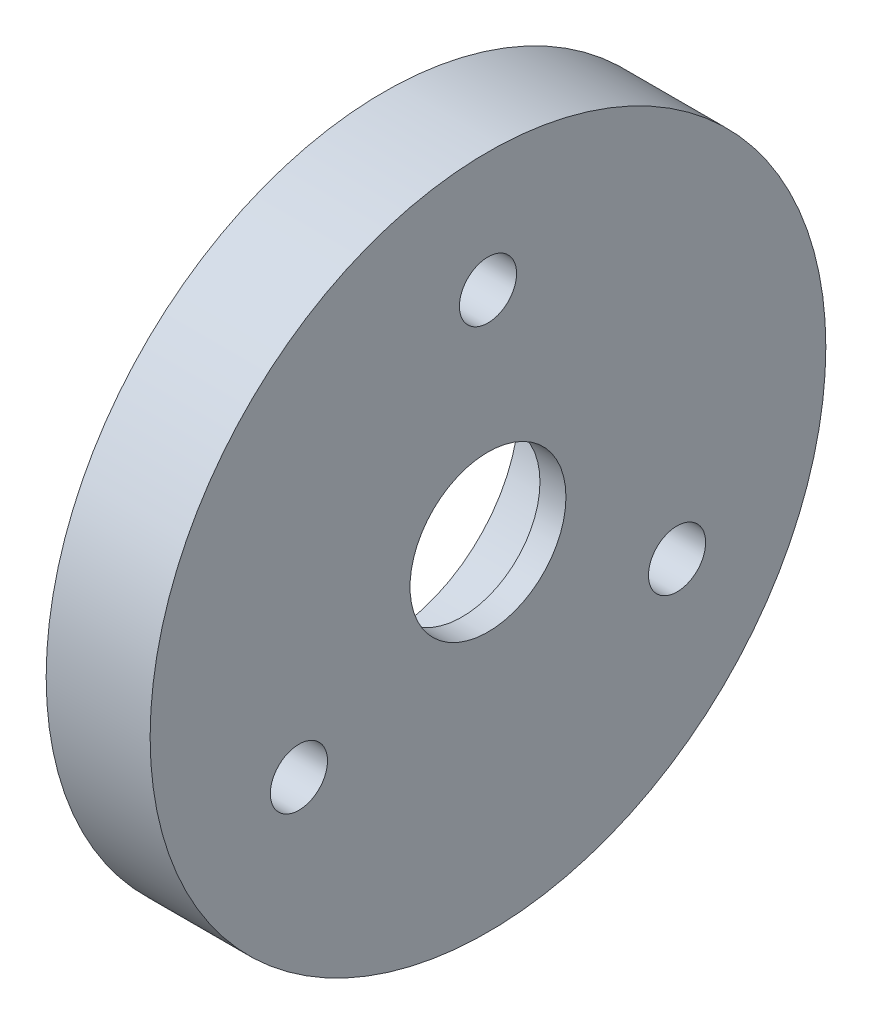
ISO-10303-21;
HEADER;
FILE_DESCRIPTION(('STEP AP214'),'2;1');
FILE_NAME('part.step','',(''),(''),'','','');
FILE_SCHEMA(('AUTOMOTIVE_DESIGN { 1 0 10303 214 1 1 1 1 }'));
ENDSEC;
DATA;
#1=APPLICATION_CONTEXT('core data for automotive mechanical design processes');
#2=APPLICATION_PROTOCOL_DEFINITION('international standard','automotive_design',2000,#1);
#3=PRODUCT_CONTEXT('',#1,'mechanical');
#4=PRODUCT('Part','Part','',(#3));
#5=PRODUCT_RELATED_PRODUCT_CATEGORY('part','',(#4));
#6=PRODUCT_DEFINITION_FORMATION('','',#4);
#7=PRODUCT_DEFINITION_CONTEXT('part definition',#1,'design');
#8=PRODUCT_DEFINITION('design','',#6,#7);
#9=PRODUCT_DEFINITION_SHAPE('','',#8);
#10=(LENGTH_UNIT() NAMED_UNIT(*) SI_UNIT(.MILLI.,.METRE.));
#11=(NAMED_UNIT(*) PLANE_ANGLE_UNIT() SI_UNIT($,.RADIAN.));
#12=(NAMED_UNIT(*) SI_UNIT($,.STERADIAN.) SOLID_ANGLE_UNIT());
#13=UNCERTAINTY_MEASURE_WITH_UNIT(LENGTH_MEASURE(1.E-05),#10,'distance_accuracy_value','');
#14=(GEOMETRIC_REPRESENTATION_CONTEXT(3) GLOBAL_UNCERTAINTY_ASSIGNED_CONTEXT((#13)) GLOBAL_UNIT_ASSIGNED_CONTEXT((#10,
#11,#12)) REPRESENTATION_CONTEXT('',''));
#15=CARTESIAN_POINT('',(0.,0.,0.));
#16=DIRECTION('',(0.,0.,1.));
#17=DIRECTION('',(1.,0.,0.));
#18=AXIS2_PLACEMENT_3D('',#15,#16,#17);
#19=CARTESIAN_POINT('',(20.,0.,0.));
#20=DIRECTION('',(-1.,0.,0.));
#21=DIRECTION('',(0.,0.,1.));
#22=AXIS2_PLACEMENT_3D('',#19,#20,#21);
#23=CYLINDRICAL_SURFACE('',#22,65.);
#24=CARTESIAN_POINT('',(20.,0.,0.));
#25=DIRECTION('',(1.,0.,0.));
#26=DIRECTION('',(0.,0.,-1.));
#27=AXIS2_PLACEMENT_3D('',#24,#25,#26);
#28=CIRCLE('',#27,65.);
#29=CARTESIAN_POINT('',(20.,0.,-65.));
#30=VERTEX_POINT('',#29);
#31=EDGE_CURVE('E10',#30,#30,#28,.T.);
#32=ORIENTED_EDGE('',*,*,#31,.F.);
#33=EDGE_LOOP('',(#32));
#34=FACE_BOUND('',#33,.T.);
#35=CARTESIAN_POINT('',(0.,0.,0.));
#36=DIRECTION('',(1.,0.,0.));
#37=DIRECTION('',(0.,0.,-1.));
#38=AXIS2_PLACEMENT_3D('',#35,#36,#37);
#39=CIRCLE('',#38,65.);
#40=CARTESIAN_POINT('',(0.,0.,-65.));
#41=VERTEX_POINT('',#40);
#42=EDGE_CURVE('E39',#41,#41,#39,.T.);
#43=ORIENTED_EDGE('',*,*,#42,.T.);
#44=EDGE_LOOP('',(#43));
#45=FACE_BOUND('',#44,.T.);
#46=ADVANCED_FACE('F32',(#34,#45),#23,.T.);
#47=CARTESIAN_POINT('',(20.,0.,0.));
#48=DIRECTION('',(1.,0.,0.));
#49=DIRECTION('',(0.,0.,-1.));
#50=AXIS2_PLACEMENT_3D('',#47,#48,#49);
#51=PLANE('',#50);
#52=CARTESIAN_POINT('',(20.,-21.0000000000002,36.3730669589463));
#53=DIRECTION('',(1.,0.,0.));
#54=DIRECTION('',(0.,0.866025403784436,0.500000000000004));
#55=AXIS2_PLACEMENT_3D('',#52,#53,#54);
#56=CIRCLE('',#55,5.5);
#57=CARTESIAN_POINT('',(20.,-16.2368602791858,39.1230669589464));
#58=VERTEX_POINT('',#57);
#59=EDGE_CURVE('E64',#58,#58,#56,.T.);
#60=ORIENTED_EDGE('',*,*,#59,.F.);
#61=EDGE_LOOP('',(#60));
#62=FACE_BOUND('',#61,.T.);
#63=CARTESIAN_POINT('',(20.,-20.9999999999997,-36.3730669589466));
#64=DIRECTION('',(1.,0.,0.));
#65=DIRECTION('',(0.,-0.866025403784443,0.499999999999992));
#66=AXIS2_PLACEMENT_3D('',#63,#64,#65);
#67=CIRCLE('',#66,5.5);
#68=CARTESIAN_POINT('',(20.,-25.7631397208141,-33.6230669589467));
#69=VERTEX_POINT('',#68);
#70=EDGE_CURVE('E65',#69,#69,#67,.T.);
#71=ORIENTED_EDGE('',*,*,#70,.F.);
#72=EDGE_LOOP('',(#71));
#73=FACE_BOUND('',#72,.T.);
#74=CARTESIAN_POINT('',(20.,42.,0.));
#75=DIRECTION('',(1.,0.,0.));
#76=DIRECTION('',(0.,0.,-1.));
#77=AXIS2_PLACEMENT_3D('',#74,#75,#76);
#78=CIRCLE('',#77,5.5);
#79=CARTESIAN_POINT('',(20.,42.,-5.5));
#80=VERTEX_POINT('',#79);
#81=EDGE_CURVE('E57',#80,#80,#78,.T.);
#82=ORIENTED_EDGE('',*,*,#81,.F.);
#83=EDGE_LOOP('',(#82));
#84=FACE_BOUND('',#83,.T.);
#85=CARTESIAN_POINT('',(20.,0.,0.));
#86=DIRECTION('',(1.,0.,0.));
#87=DIRECTION('',(0.,0.,-1.));
#88=AXIS2_PLACEMENT_3D('',#85,#86,#87);
#89=CIRCLE('',#88,15.);
#90=CARTESIAN_POINT('',(20.,0.,-15.));
#91=VERTEX_POINT('',#90);
#92=EDGE_CURVE('E51',#91,#91,#89,.T.);
#93=ORIENTED_EDGE('',*,*,#92,.F.);
#94=EDGE_LOOP('',(#93));
#95=FACE_BOUND('',#94,.T.);
#96=ORIENTED_EDGE('',*,*,#31,.T.);
#97=EDGE_LOOP('',(#96));
#98=FACE_BOUND('',#97,.T.);
#99=ADVANCED_FACE('F76',(#62,#73,#84,#95,#98),#51,.T.);
#100=CARTESIAN_POINT('',(0.,0.,0.));
#101=DIRECTION('',(1.,0.,0.));
#102=DIRECTION('',(0.,0.,-1.));
#103=AXIS2_PLACEMENT_3D('',#100,#101,#102);
#104=PLANE('',#103);
#105=CARTESIAN_POINT('',(0.,-21.0000000000002,36.3730669589463));
#106=DIRECTION('',(1.,0.,0.));
#107=DIRECTION('',(0.,0.866025403784436,0.500000000000004));
#108=AXIS2_PLACEMENT_3D('',#105,#106,#107);
#109=CIRCLE('',#108,5.5);
#110=CARTESIAN_POINT('',(0.,-16.2368602791858,39.1230669589464));
#111=VERTEX_POINT('',#110);
#112=EDGE_CURVE('E60',#111,#111,#109,.F.);
#113=ORIENTED_EDGE('',*,*,#112,.F.);
#114=EDGE_LOOP('',(#113));
#115=FACE_BOUND('',#114,.T.);
#116=CARTESIAN_POINT('',(0.,-20.9999999999997,-36.3730669589466));
#117=DIRECTION('',(1.,0.,0.));
#118=DIRECTION('',(0.,-0.866025403784443,0.499999999999992));
#119=AXIS2_PLACEMENT_3D('',#116,#117,#118);
#120=CIRCLE('',#119,5.5);
#121=CARTESIAN_POINT('',(0.,-25.7631397208141,-33.6230669589467));
#122=VERTEX_POINT('',#121);
#123=EDGE_CURVE('E61',#122,#122,#120,.F.);
#124=ORIENTED_EDGE('',*,*,#123,.F.);
#125=EDGE_LOOP('',(#124));
#126=FACE_BOUND('',#125,.T.);
#127=CARTESIAN_POINT('',(0.,42.,0.));
#128=DIRECTION('',(1.,0.,0.));
#129=DIRECTION('',(0.,0.,-1.));
#130=AXIS2_PLACEMENT_3D('',#127,#128,#129);
#131=CIRCLE('',#130,5.5);
#132=CARTESIAN_POINT('',(0.,42.,-5.5));
#133=VERTEX_POINT('',#132);
#134=EDGE_CURVE('E54',#133,#133,#131,.F.);
#135=ORIENTED_EDGE('',*,*,#134,.F.);
#136=EDGE_LOOP('',(#135));
#137=FACE_BOUND('',#136,.T.);
#138=CARTESIAN_POINT('',(0.,0.,0.));
#139=DIRECTION('',(1.,0.,0.));
#140=DIRECTION('',(0.,0.,-1.));
#141=AXIS2_PLACEMENT_3D('',#138,#139,#140);
#142=CIRCLE('',#141,26.);
#143=CARTESIAN_POINT('',(0.,0.,-26.));
#144=VERTEX_POINT('',#143);
#145=EDGE_CURVE('E46',#144,#144,#142,.T.);
#146=ORIENTED_EDGE('',*,*,#145,.T.);
#147=EDGE_LOOP('',(#146));
#148=FACE_BOUND('',#147,.T.);
#149=ORIENTED_EDGE('',*,*,#42,.F.);
#150=EDGE_LOOP('',(#149));
#151=FACE_BOUND('',#150,.T.);
#152=ADVANCED_FACE('F79',(#115,#126,#137,#148,#151),#104,.F.);
#153=CARTESIAN_POINT('',(15.,0.,0.));
#154=DIRECTION('',(-1.,0.,0.));
#155=DIRECTION('',(0.,0.,1.));
#156=AXIS2_PLACEMENT_3D('',#153,#154,#155);
#157=CYLINDRICAL_SURFACE('',#156,26.);
#158=CARTESIAN_POINT('',(15.,0.,0.));
#159=DIRECTION('',(1.,0.,0.));
#160=DIRECTION('',(0.,0.,-1.));
#161=AXIS2_PLACEMENT_3D('',#158,#159,#160);
#162=CIRCLE('',#161,26.);
#163=CARTESIAN_POINT('',(15.,0.,-26.));
#164=VERTEX_POINT('',#163);
#165=EDGE_CURVE('E44',#164,#164,#162,.T.);
#166=ORIENTED_EDGE('',*,*,#165,.T.);
#167=EDGE_LOOP('',(#166));
#168=FACE_BOUND('',#167,.T.);
#169=ORIENTED_EDGE('',*,*,#145,.F.);
#170=EDGE_LOOP('',(#169));
#171=FACE_BOUND('',#170,.T.);
#172=ADVANCED_FACE('F98',(#168,#171),#157,.F.);
#173=CARTESIAN_POINT('',(15.,0.,0.));
#174=DIRECTION('',(1.,0.,0.));
#175=DIRECTION('',(0.,0.,-1.));
#176=AXIS2_PLACEMENT_3D('',#173,#174,#175);
#177=PLANE('',#176);
#178=CARTESIAN_POINT('',(15.,0.,0.));
#179=DIRECTION('',(1.,0.,0.));
#180=DIRECTION('',(0.,0.,-1.));
#181=AXIS2_PLACEMENT_3D('',#178,#179,#180);
#182=CIRCLE('',#181,15.);
#183=CARTESIAN_POINT('',(15.,0.,-15.));
#184=VERTEX_POINT('',#183);
#185=EDGE_CURVE('E35',#184,#184,#182,.T.);
#186=ORIENTED_EDGE('',*,*,#185,.T.);
#187=EDGE_LOOP('',(#186));
#188=FACE_BOUND('',#187,.T.);
#189=ORIENTED_EDGE('',*,*,#165,.F.);
#190=EDGE_LOOP('',(#189));
#191=FACE_BOUND('',#190,.T.);
#192=ADVANCED_FACE('F91',(#188,#191),#177,.F.);
#193=CARTESIAN_POINT('',(0.,0.,0.));
#194=DIRECTION('',(1.,0.,0.));
#195=DIRECTION('',(0.,0.,-1.));
#196=AXIS2_PLACEMENT_3D('',#193,#194,#195);
#197=CYLINDRICAL_SURFACE('',#196,15.);
#198=ORIENTED_EDGE('',*,*,#92,.T.);
#199=EDGE_LOOP('',(#198));
#200=FACE_BOUND('',#199,.T.);
#201=ORIENTED_EDGE('',*,*,#185,.F.);
#202=EDGE_LOOP('',(#201));
#203=FACE_BOUND('',#202,.T.);
#204=ADVANCED_FACE('F87',(#200,#203),#197,.F.);
#205=CARTESIAN_POINT('',(-0.001000000000001,42.,0.));
#206=DIRECTION('',(1.,0.,0.));
#207=DIRECTION('',(0.,0.,-1.));
#208=AXIS2_PLACEMENT_3D('',#205,#206,#207);
#209=CYLINDRICAL_SURFACE('',#208,5.5);
#210=ORIENTED_EDGE('',*,*,#81,.T.);
#211=EDGE_LOOP('',(#210));
#212=FACE_BOUND('',#211,.T.);
#213=ORIENTED_EDGE('',*,*,#134,.T.);
#214=EDGE_LOOP('',(#213));
#215=FACE_BOUND('',#214,.T.);
#216=ADVANCED_FACE('F90',(#212,#215),#209,.F.);
#217=CARTESIAN_POINT('',(-0.001000000000001,-20.9999999999997,-36.3730669589466));
#218=DIRECTION('',(1.,0.,0.));
#219=DIRECTION('',(0.,-0.866025403784443,0.499999999999992));
#220=AXIS2_PLACEMENT_3D('',#217,#218,#219);
#221=CYLINDRICAL_SURFACE('',#220,5.5);
#222=ORIENTED_EDGE('',*,*,#70,.T.);
#223=EDGE_LOOP('',(#222));
#224=FACE_BOUND('',#223,.T.);
#225=ORIENTED_EDGE('',*,*,#123,.T.);
#226=EDGE_LOOP('',(#225));
#227=FACE_BOUND('',#226,.T.);
#228=ADVANCED_FACE('F148',(#224,#227),#221,.F.);
#229=CARTESIAN_POINT('',(-0.001000000000001,-21.0000000000002,36.3730669589463));
#230=DIRECTION('',(1.,0.,0.));
#231=DIRECTION('',(0.,0.866025403784436,0.500000000000004));
#232=AXIS2_PLACEMENT_3D('',#229,#230,#231);
#233=CYLINDRICAL_SURFACE('',#232,5.5);
#234=ORIENTED_EDGE('',*,*,#59,.T.);
#235=EDGE_LOOP('',(#234));
#236=FACE_BOUND('',#235,.T.);
#237=ORIENTED_EDGE('',*,*,#112,.T.);
#238=EDGE_LOOP('',(#237));
#239=FACE_BOUND('',#238,.T.);
#240=ADVANCED_FACE('F73',(#236,#239),#233,.F.);
#241=CLOSED_SHELL('',(#46,#99,#152,#172,#192,#204,#216,#228,#240));
#242=MANIFOLD_SOLID_BREP('B2',#241);
#243=ADVANCED_BREP_SHAPE_REPRESENTATION('',(#18,#242),#14);
#244=SHAPE_DEFINITION_REPRESENTATION(#9,#243);
ENDSEC;
END-ISO-10303-21;
